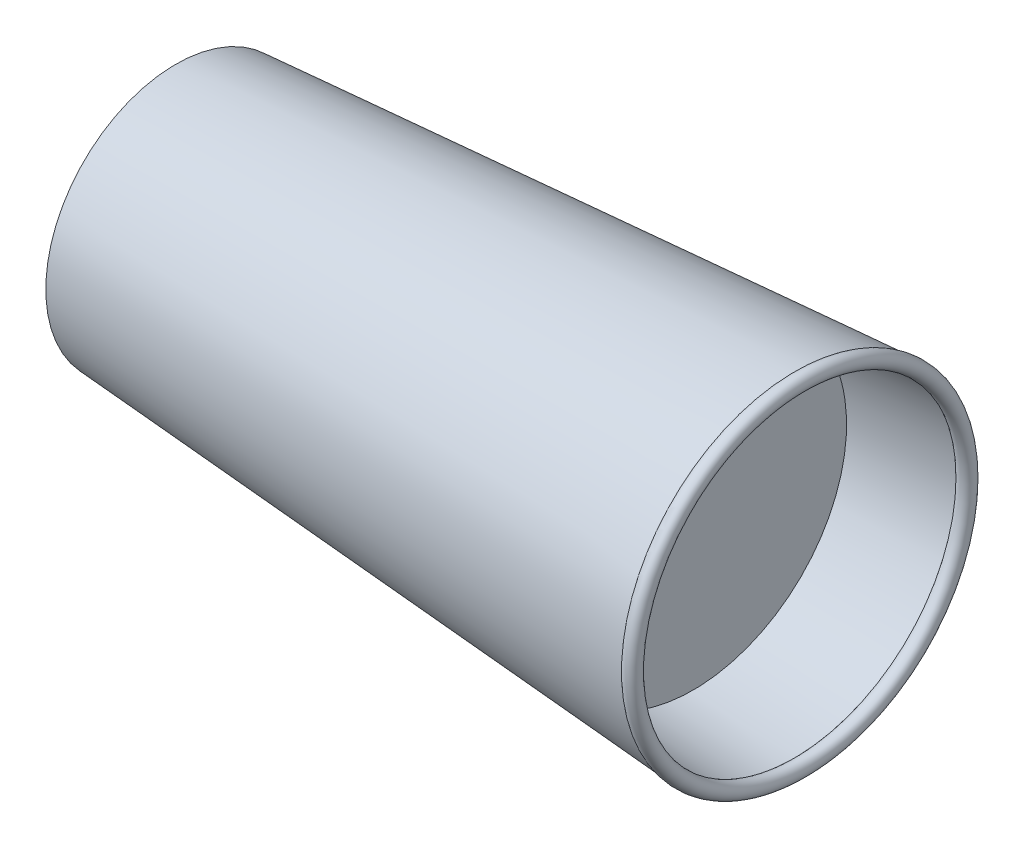
ISO-10303-21;
HEADER;
FILE_DESCRIPTION(('STEP AP214'),'2;1');
FILE_NAME('part.step','',(''),(''),'','','');
FILE_SCHEMA(('AUTOMOTIVE_DESIGN { 1 0 10303 214 1 1 1 1 }'));
ENDSEC;
DATA;
#1=APPLICATION_CONTEXT('core data for automotive mechanical design processes');
#2=APPLICATION_PROTOCOL_DEFINITION('international standard','automotive_design',2000,#1);
#3=PRODUCT_CONTEXT('',#1,'mechanical');
#4=PRODUCT('Part','Part','',(#3));
#5=PRODUCT_RELATED_PRODUCT_CATEGORY('part','',(#4));
#6=PRODUCT_DEFINITION_FORMATION('','',#4);
#7=PRODUCT_DEFINITION_CONTEXT('part definition',#1,'design');
#8=PRODUCT_DEFINITION('design','',#6,#7);
#9=PRODUCT_DEFINITION_SHAPE('','',#8);
#10=(LENGTH_UNIT() NAMED_UNIT(*) SI_UNIT(.MILLI.,.METRE.));
#11=(NAMED_UNIT(*) PLANE_ANGLE_UNIT() SI_UNIT($,.RADIAN.));
#12=(NAMED_UNIT(*) SI_UNIT($,.STERADIAN.) SOLID_ANGLE_UNIT());
#13=UNCERTAINTY_MEASURE_WITH_UNIT(LENGTH_MEASURE(1.E-05),#10,'distance_accuracy_value','');
#14=(GEOMETRIC_REPRESENTATION_CONTEXT(3) GLOBAL_UNCERTAINTY_ASSIGNED_CONTEXT((#13)) GLOBAL_UNIT_ASSIGNED_CONTEXT((#10,
#11,#12)) REPRESENTATION_CONTEXT('',''));
#15=CARTESIAN_POINT('',(0.,0.,0.));
#16=DIRECTION('',(0.,0.,1.));
#17=DIRECTION('',(1.,0.,0.));
#18=AXIS2_PLACEMENT_3D('',#15,#16,#17);
#19=CARTESIAN_POINT('',(0.,0.,0.));
#20=DIRECTION('',(1.,0.,0.));
#21=DIRECTION('',(0.,0.,-1.));
#22=AXIS2_PLACEMENT_3D('',#19,#20,#21);
#23=CONICAL_SURFACE('',#22,31.75,0.0698131700797733);
#24=CARTESIAN_POINT('',(151.188277899687,0.,0.));
#25=DIRECTION('',(1.,0.,0.));
#26=DIRECTION('',(0.,0.,-1.));
#27=AXIS2_PLACEMENT_3D('',#24,#25,#26);
#28=CIRCLE('',#27,42.3221142767546);
#29=CARTESIAN_POINT('',(151.188277899687,0.,-42.3221142767546));
#30=VERTEX_POINT('',#29);
#31=EDGE_CURVE('E57',#30,#30,#28,.F.);
#32=ORIENTED_EDGE('',*,*,#31,.T.);
#33=EDGE_LOOP('',(#32));
#34=FACE_BOUND('',#33,.T.);
#35=CARTESIAN_POINT('',(0.,0.,0.));
#36=DIRECTION('',(1.,0.,0.));
#37=DIRECTION('',(0.,0.,-1.));
#38=AXIS2_PLACEMENT_3D('',#35,#36,#37);
#39=CIRCLE('',#38,31.75);
#40=CARTESIAN_POINT('',(0.,0.,-31.75));
#41=VERTEX_POINT('',#40);
#42=EDGE_CURVE('E46',#41,#41,#39,.T.);
#43=ORIENTED_EDGE('',*,*,#42,.T.);
#44=EDGE_LOOP('',(#43));
#45=FACE_BOUND('',#44,.T.);
#46=ADVANCED_FACE('F39',(#34,#45),#23,.T.);
#47=CARTESIAN_POINT('',(0.,0.,0.));
#48=DIRECTION('',(1.,0.,0.));
#49=DIRECTION('',(0.,0.,-1.));
#50=AXIS2_PLACEMENT_3D('',#47,#48,#49);
#51=PLANE('',#50);
#52=CARTESIAN_POINT('',(0.,0.,0.));
#53=DIRECTION('',(-1.,0.,0.));
#54=DIRECTION('',(0.,0.,1.));
#55=AXIS2_PLACEMENT_3D('',#52,#53,#54);
#56=CIRCLE('',#55,29.21);
#57=CARTESIAN_POINT('',(0.,0.,29.21));
#58=VERTEX_POINT('',#57);
#59=EDGE_CURVE('E56',#58,#58,#56,.T.);
#60=ORIENTED_EDGE('',*,*,#59,.F.);
#61=EDGE_LOOP('',(#60));
#62=FACE_BOUND('',#61,.T.);
#63=ORIENTED_EDGE('',*,*,#42,.F.);
#64=EDGE_LOOP('',(#63));
#65=FACE_BOUND('',#64,.T.);
#66=ADVANCED_FACE('F79',(#62,#65),#51,.F.);
#67=CARTESIAN_POINT('',(3.175,0.,0.));
#68=DIRECTION('',(-1.,0.,0.));
#69=DIRECTION('',(0.,0.,1.));
#70=AXIS2_PLACEMENT_3D('',#67,#68,#69);
#71=CYLINDRICAL_SURFACE('',#70,29.21);
#72=CARTESIAN_POINT('',(3.175,0.,0.));
#73=DIRECTION('',(-1.,0.,0.));
#74=DIRECTION('',(0.,0.,1.));
#75=AXIS2_PLACEMENT_3D('',#72,#73,#74);
#76=CIRCLE('',#75,29.21);
#77=CARTESIAN_POINT('',(3.175,0.,29.21));
#78=VERTEX_POINT('',#77);
#79=EDGE_CURVE('E51',#78,#78,#76,.T.);
#80=ORIENTED_EDGE('',*,*,#79,.F.);
#81=EDGE_LOOP('',(#80));
#82=FACE_BOUND('',#81,.T.);
#83=ORIENTED_EDGE('',*,*,#59,.T.);
#84=EDGE_LOOP('',(#83));
#85=FACE_BOUND('',#84,.T.);
#86=ADVANCED_FACE('F76',(#82,#85),#71,.F.);
#87=CARTESIAN_POINT('',(3.175,0.,0.));
#88=DIRECTION('',(-1.,0.,0.));
#89=DIRECTION('',(0.,0.,1.));
#90=AXIS2_PLACEMENT_3D('',#87,#88,#89);
#91=PLANE('',#90);
#92=ORIENTED_EDGE('',*,*,#79,.T.);
#93=EDGE_LOOP('',(#92));
#94=FACE_BOUND('',#93,.T.);
#95=ADVANCED_FACE('F74',(#94),#91,.T.);
#96=CARTESIAN_POINT('',(152.4,0.,0.));
#97=DIRECTION('',(1.,0.,0.));
#98=DIRECTION('',(0.,0.,-1.));
#99=AXIS2_PLACEMENT_3D('',#96,#97,#98);
#100=TOROIDAL_SURFACE('',#99,40.8521637498173,1.90499999999999);
#101=CARTESIAN_POINT('',(150.844866347489,0.,0.));
#102=DIRECTION('',(1.,0.,0.));
#103=DIRECTION('',(0.,0.,-1.));
#104=AXIS2_PLACEMENT_3D('',#101,#102,#103);
#105=CIRCLE('',#104,39.7518981805987);
#106=CARTESIAN_POINT('',(150.844866347489,0.,-39.7518981805987));
#107=VERTEX_POINT('',#106);
#108=EDGE_CURVE('E11',#107,#107,#105,.F.);
#109=ORIENTED_EDGE('',*,*,#108,.T.);
#110=EDGE_LOOP('',(#109));
#111=FACE_BOUND('',#110,.T.);
#112=ORIENTED_EDGE('',*,*,#31,.F.);
#113=EDGE_LOOP('',(#112));
#114=FACE_BOUND('',#113,.T.);
#115=ADVANCED_FACE('F105',(#111,#114),#100,.T.);
#116=CARTESIAN_POINT('',(0.177181443310079,0.,0.));
#117=DIRECTION('',(1.,0.,0.));
#118=DIRECTION('',(0.,0.,-1.));
#119=AXIS2_PLACEMENT_3D('',#116,#117,#118);
#120=CONICAL_SURFACE('',#119,29.21618731234,0.0698131700797733);
#121=ORIENTED_EDGE('',*,*,#108,.F.);
#122=EDGE_LOOP('',(#121));
#123=FACE_BOUND('',#122,.T.);
#124=CARTESIAN_POINT('',(5.715,0.,0.));
#125=DIRECTION('',(1.,0.,0.));
#126=DIRECTION('',(0.,0.,-1.));
#127=AXIS2_PLACEMENT_3D('',#124,#125,#126);
#128=CIRCLE('',#127,29.603429309131);
#129=CARTESIAN_POINT('',(5.715,9.13027092807213,28.1602766257847));
#130=VERTEX_POINT('',#129);
#131=EDGE_CURVE('E54',#130,#130,#128,.T.);
#132=ORIENTED_EDGE('',*,*,#131,.F.);
#133=EDGE_LOOP('',(#132));
#134=FACE_BOUND('',#133,.T.);
#135=ADVANCED_FACE('F111',(#123,#134),#120,.F.);
#136=CARTESIAN_POINT('',(126.365,0.,0.));
#137=DIRECTION('',(1.,0.,0.));
#138=DIRECTION('',(0.,0.,-1.));
#139=AXIS2_PLACEMENT_3D('',#136,#137,#138);
#140=PLANE('',#139);
#141=CARTESIAN_POINT('',(126.365,0.,0.));
#142=DIRECTION('',(1.,0.,0.));
#143=DIRECTION('',(0.,0.,-1.));
#144=AXIS2_PLACEMENT_3D('',#141,#142,#143);
#145=CIRCLE('',#144,37.479680565154);
#146=CARTESIAN_POINT('',(126.365,-16.6999307991682,33.5535209265581));
#147=VERTEX_POINT('',#146);
#148=EDGE_CURVE('E62',#147,#147,#145,.T.);
#149=ORIENTED_EDGE('',*,*,#148,.T.);
#150=EDGE_LOOP('',(#149));
#151=FACE_BOUND('',#150,.T.);
#152=ADVANCED_FACE('F118',(#151),#140,.T.);
#153=CARTESIAN_POINT('',(5.715,9.13027092807213,28.1602766257847));
#154=CARTESIAN_POINT('',(126.365,-16.6999307991682,33.5535209265581));
#155=CARTESIAN_POINT('',(5.715,-47.1902823234972,46.4208184819289));
#156=CARTESIAN_POINT('',(126.365,-83.8069726522845,0.153659328221721));
#157=CARTESIAN_POINT('',(5.715,-65.4508241796415,-9.89973476964038));
#158=CARTESIAN_POINT('',(126.365,-50.4071110539481,-66.9533825248946));
#159=CARTESIAN_POINT('',(5.715,-9.13027092807216,-28.1602766257847));
#160=CARTESIAN_POINT('',(126.365,16.6999307991682,-33.5535209265581));
#161=CARTESIAN_POINT('',(5.715,47.1902823234972,-46.420818481929));
#162=CARTESIAN_POINT('',(126.365,83.8069726522845,-0.153659328221707));
#163=CARTESIAN_POINT('',(5.715,65.4508241796415,9.89973476964038));
#164=CARTESIAN_POINT('',(126.365,50.4071110539481,66.9533825248946));
#165=CARTESIAN_POINT('',(5.715,9.13027092807213,28.1602766257847));
#166=CARTESIAN_POINT('',(126.365,-16.6999307991682,33.5535209265581));
#167=(BOUNDED_SURFACE() B_SPLINE_SURFACE(3,1,((#153,#154),(#155,#156),(#157,#158),(#159,#160),
(#161,#162),(#163,#164),(#165,#166)),.UNSPECIFIED.,.T.,.F.,.F.) B_SPLINE_SURFACE_WITH_KNOTS((4,
3,4),(2,2),(0.,0.5,1.),(0.,1.),
.UNSPECIFIED.) GEOMETRIC_REPRESENTATION_ITEM() RATIONAL_B_SPLINE_SURFACE(((1.,1.),
(0.333333333333334,0.333333333333333),(0.333333333333334,0.333333333333333),(1.,1.),
(0.333333333333333,0.333333333333333),(0.333333333333333,0.333333333333333),(1.,1.))) REPRESENTATION_ITEM('') SURFACE());
#168=CARTESIAN_POINT('',(5.715,9.13027092807213,28.1602766257847));
#169=CARTESIAN_POINT('',(6.97177083333333,8.86120632674671,28.2164562539178));
#170=CARTESIAN_POINT('',(8.22854166666667,8.59214172542129,28.2726358820508));
#171=CARTESIAN_POINT('',(10.7420833333333,8.05401252277045,28.3849951383169));
#172=CARTESIAN_POINT('',(11.9988541666667,7.78494792144503,28.44117476645));
#173=CARTESIAN_POINT('',(14.5123958333333,7.24681871879419,28.5535340227161));
#174=CARTESIAN_POINT('',(15.7691666666667,6.97775411746877,28.6097136508492));
#175=CARTESIAN_POINT('',(18.2827083333333,6.43962491481793,28.7220729071153));
#176=CARTESIAN_POINT('',(19.5394791666667,6.17056031349251,28.7782525352483));
#177=CARTESIAN_POINT('',(22.0530208333333,5.63243111084167,28.8906117915144));
#178=CARTESIAN_POINT('',(23.3097916666667,5.36336650951625,28.9467914196475));
#179=CARTESIAN_POINT('',(25.8233333333333,4.82523730686541,29.0591506759136));
#180=CARTESIAN_POINT('',(27.0801041666667,4.55617270553999,29.1153303040467));
#181=CARTESIAN_POINT('',(29.5936458333333,4.01804350288915,29.2276895603128));
#182=CARTESIAN_POINT('',(30.8504166666667,3.74897890156373,29.2838691884458));
#183=CARTESIAN_POINT('',(33.3639583333333,3.21084969891289,29.3962284447119));
#184=CARTESIAN_POINT('',(34.6207291666667,2.94178509758747,29.452408072845));
#185=CARTESIAN_POINT('',(37.1342708333333,2.40365589493662,29.5647673291111));
#186=CARTESIAN_POINT('',(38.3910416666667,2.13459129361121,29.6209469572442));
#187=CARTESIAN_POINT('',(40.9045833333333,1.59646209096037,29.7333062135103));
#188=CARTESIAN_POINT('',(42.1613541666667,1.32739748963494,29.7894858416433));
#189=CARTESIAN_POINT('',(44.6748958333333,0.789268286984103,29.9018450979095));
#190=CARTESIAN_POINT('',(45.9316666666667,0.520203685658682,29.9580247260425));
#191=CARTESIAN_POINT('',(48.4452083333333,-0.0179255169921587,30.0703839823086));
#192=CARTESIAN_POINT('',(49.7019791666667,-0.286990118317578,30.1265636104417));
#193=CARTESIAN_POINT('',(52.2155208333333,-0.825119320968418,30.2389228667078));
#194=CARTESIAN_POINT('',(53.4722916666667,-1.09418392229384,30.2951024948409));
#195=CARTESIAN_POINT('',(55.9858333333333,-1.63231312494468,30.407461751107));
#196=CARTESIAN_POINT('',(57.2426041666667,-1.9013777262701,30.46364137924));
#197=CARTESIAN_POINT('',(59.7561458333333,-2.43950692892094,30.5760006355061));
#198=CARTESIAN_POINT('',(61.0129166666667,-2.70857153024636,30.6321802636392));
#199=CARTESIAN_POINT('',(63.5264583333333,-3.2467007328972,30.7445395199053));
#200=CARTESIAN_POINT('',(64.7832291666667,-3.51576533422262,30.8007191480384));
#201=CARTESIAN_POINT('',(67.2967708333333,-4.05389453687346,30.9130784043045));
#202=CARTESIAN_POINT('',(68.5535416666667,-4.32295913819888,30.9692580324375));
#203=CARTESIAN_POINT('',(71.0670833333333,-4.86108834084972,31.0816172887037));
#204=CARTESIAN_POINT('',(72.3238541666667,-5.13015294217514,31.1377969168367));
#205=CARTESIAN_POINT('',(74.8373958333333,-5.66828214482598,31.2501561731028));
#206=CARTESIAN_POINT('',(76.0941666666667,-5.93734674615141,31.3063358012359));
#207=CARTESIAN_POINT('',(78.6077083333333,-6.47547594880225,31.418695057502));
#208=CARTESIAN_POINT('',(79.8644791666667,-6.74454055012767,31.4748746856351));
#209=CARTESIAN_POINT('',(82.3780208333333,-7.28266975277851,31.5872339419012));
#210=CARTESIAN_POINT('',(83.6347916666667,-7.55173435410393,31.6434135700342));
#211=CARTESIAN_POINT('',(86.1483333333333,-8.08986355675477,31.7557728263003));
#212=CARTESIAN_POINT('',(87.4051041666667,-8.35892815808019,31.8119524544334));
#213=CARTESIAN_POINT('',(89.9186458333333,-8.89705736073103,31.9243117106995));
#214=CARTESIAN_POINT('',(91.1754166666667,-9.16612196205645,31.9804913388326));
#215=CARTESIAN_POINT('',(93.6889583333333,-9.70425116470729,32.0928505950987));
#216=CARTESIAN_POINT('',(94.9457291666667,-9.97331576603271,32.1490302232317));
#217=CARTESIAN_POINT('',(97.4592708333333,-10.5114449686836,32.2613894794978));
#218=CARTESIAN_POINT('',(98.7160416666667,-10.780509570009,32.3175691076309));
#219=CARTESIAN_POINT('',(101.229583333333,-11.3186387726598,32.429928363897));
#220=CARTESIAN_POINT('',(102.486354166667,-11.5877033739852,32.4861079920301));
#221=CARTESIAN_POINT('',(104.999895833333,-12.1258325766361,32.5984672482962));
#222=CARTESIAN_POINT('',(106.256666666667,-12.3948971779615,32.6546468764292));
#223=CARTESIAN_POINT('',(108.770208333333,-12.9330263806123,32.7670061326954));
#224=CARTESIAN_POINT('',(110.026979166667,-13.2020909819378,32.8231857608284));
#225=CARTESIAN_POINT('',(112.540520833333,-13.7402201845886,32.9355450170945));
#226=CARTESIAN_POINT('',(113.797291666667,-14.009284785914,32.9917246452276));
#227=CARTESIAN_POINT('',(116.310833333333,-14.5474139885649,33.1040839014937));
#228=CARTESIAN_POINT('',(117.567604166667,-14.8164785898903,33.1602635296268));
#229=CARTESIAN_POINT('',(120.081145833333,-15.3546077925411,33.2726227858929));
#230=CARTESIAN_POINT('',(121.337916666667,-15.6236723938665,33.3288024140259));
#231=CARTESIAN_POINT('',(123.851458333333,-16.1618015965174,33.441161670292));
#232=CARTESIAN_POINT('',(125.108229166667,-16.4308661978428,33.4973412984251));
#233=CARTESIAN_POINT('',(126.365,-16.6999307991682,33.5535209265581));
#234=B_SPLINE_CURVE_WITH_KNOTS('',3,(#168,#169,#170,#171,#172,#173,#174,#175,#176,#177,#178,
#179,#180,#181,#182,#183,#184,#185,#186,#187,#188,#189,#190,#191,#192,#193,#194,#195,#196,#197,
#198,#199,#200,#201,#202,#203,#204,#205,#206,#207,#208,#209,#210,#211,#212,#213,#214,#215,#216,
#217,#218,#219,#220,#221,#222,#223,#224,#225,#226,#227,#228,#229,#230,#231,#232,#233),
.UNSPECIFIED.,.F.,.F.,(4,2,2,2,2,2,2,2,2,2,2,2,2,2,2,2,2,2,2,2,2,2,2,2,2,2,2,2,2,2,2,2,4),(0.,
3.85943305945166,7.71886611890333,11.578299178355,15.4377322378067,19.2971652972583,
23.15659835671,27.0160314161616,30.8754644756133,34.734897535065,38.5943305945166,
42.4537636539683,46.31319671342,50.1726297728716,54.0320628323233,57.891495891775,
61.7509289512266,65.6103620106783,69.46979507013,73.3292281295816,77.1886611890333,
81.0480942484849,84.9075273079366,88.7669603673883,92.6263934268399,96.4858264862916,
100.345259545743,104.204692605195,108.064125664647,111.923558724098,115.78299178355,
119.642424843002,123.501857902453),.UNSPECIFIED.);
#235=EDGE_CURVE('BSEAM126',#130,#147,#234,.T.);
#236=ORIENTED_EDGE('',*,*,#131,.T.);
#237=ORIENTED_EDGE('',*,*,#148,.F.);
#238=ORIENTED_EDGE('',*,*,#235,.T.);
#239=ORIENTED_EDGE('',*,*,#235,.F.);
#240=EDGE_LOOP('',(#236,#238,#237,#239));
#241=FACE_BOUND('',#240,.T.);
#242=ADVANCED_FACE('F126',(#241),#167,.T.);
#243=CLOSED_SHELL('',(#46,#66,#86,#95,#115,#135,#152,#242));
#244=MANIFOLD_SOLID_BREP('B2',#243);
#245=ADVANCED_BREP_SHAPE_REPRESENTATION('',(#18,#244),#14);
#246=SHAPE_DEFINITION_REPRESENTATION(#9,#245);
ENDSEC;
END-ISO-10303-21;
